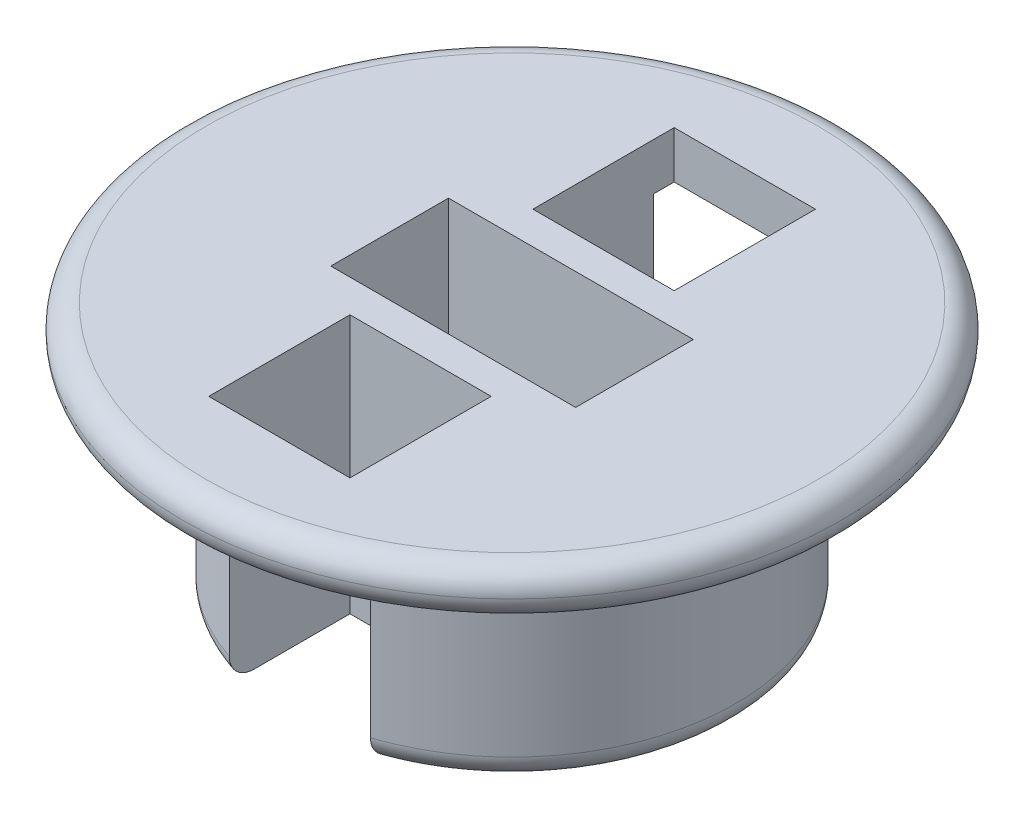
ISO-10303-21;
HEADER;
FILE_DESCRIPTION(('STEP AP214'),'2;1');
FILE_NAME('part.step','',(''),(''),'','','');
FILE_SCHEMA(('AUTOMOTIVE_DESIGN { 1 0 10303 214 1 1 1 1 }'));
ENDSEC;
DATA;
#1=APPLICATION_CONTEXT('core data for automotive mechanical design processes');
#2=APPLICATION_PROTOCOL_DEFINITION('international standard','automotive_design',2000,#1);
#3=PRODUCT_CONTEXT('',#1,'mechanical');
#4=PRODUCT('Part','Part','',(#3));
#5=PRODUCT_RELATED_PRODUCT_CATEGORY('part','',(#4));
#6=PRODUCT_DEFINITION_FORMATION('','',#4);
#7=PRODUCT_DEFINITION_CONTEXT('part definition',#1,'design');
#8=PRODUCT_DEFINITION('design','',#6,#7);
#9=PRODUCT_DEFINITION_SHAPE('','',#8);
#10=(LENGTH_UNIT() NAMED_UNIT(*) SI_UNIT(.MILLI.,.METRE.));
#11=(NAMED_UNIT(*) PLANE_ANGLE_UNIT() SI_UNIT($,.RADIAN.));
#12=(NAMED_UNIT(*) SI_UNIT($,.STERADIAN.) SOLID_ANGLE_UNIT());
#13=UNCERTAINTY_MEASURE_WITH_UNIT(LENGTH_MEASURE(1.E-05),#10,'distance_accuracy_value','');
#14=(GEOMETRIC_REPRESENTATION_CONTEXT(3) GLOBAL_UNCERTAINTY_ASSIGNED_CONTEXT((#13)) GLOBAL_UNIT_ASSIGNED_CONTEXT((#10,
#11,#12)) REPRESENTATION_CONTEXT('',''));
#15=CARTESIAN_POINT('',(0.,0.,0.));
#16=DIRECTION('',(0.,0.,1.));
#17=DIRECTION('',(1.,0.,0.));
#18=AXIS2_PLACEMENT_3D('',#15,#16,#17);
#19=CARTESIAN_POINT('',(0.,4.5,0.));
#20=DIRECTION('',(0.,-1.,0.));
#21=DIRECTION('',(0.,0.,-1.));
#22=AXIS2_PLACEMENT_3D('',#19,#20,#21);
#23=CYLINDRICAL_SURFACE('',#22,4.75);
#24=DIRECTION('',(0.,-1.,0.));
#25=VECTOR('',#24,1.);
#26=CARTESIAN_POINT('',(-1.5,4.5,-4.50693909432999));
#27=LINE('',#26,#25);
#28=CARTESIAN_POINT('',(-1.5,0.5,-4.50693909432999));
#29=VERTEX_POINT('',#28);
#30=CARTESIAN_POINT('',(-1.5,4.5,-4.50693909432999));
#31=VERTEX_POINT('',#30);
#32=EDGE_CURVE('E307',#29,#31,#27,.F.);
#33=ORIENTED_EDGE('',*,*,#32,.F.);
#34=CARTESIAN_POINT('',(0.,0.5,0.));
#35=DIRECTION('',(0.,1.,0.));
#36=DIRECTION('',(0.,0.,1.));
#37=AXIS2_PLACEMENT_3D('',#34,#35,#36);
#38=CIRCLE('',#37,4.75);
#39=CARTESIAN_POINT('',(-1.5,0.5,4.50693909432999));
#40=VERTEX_POINT('',#39);
#41=EDGE_CURVE('E376',#29,#40,#38,.T.);
#42=ORIENTED_EDGE('',*,*,#41,.T.);
#43=DIRECTION('',(0.,-1.,0.));
#44=VECTOR('',#43,1.);
#45=CARTESIAN_POINT('',(-1.5,4.5,4.50693909432999));
#46=LINE('',#45,#44);
#47=CARTESIAN_POINT('',(-1.5,4.5,4.50693909432999));
#48=VERTEX_POINT('',#47);
#49=EDGE_CURVE('E258',#40,#48,#46,.F.);
#50=ORIENTED_EDGE('',*,*,#49,.T.);
#51=CARTESIAN_POINT('',(0.,4.5,0.));
#52=DIRECTION('',(0.,1.,0.));
#53=DIRECTION('',(0.,0.,1.));
#54=AXIS2_PLACEMENT_3D('',#51,#52,#53);
#55=CIRCLE('',#54,4.75);
#56=EDGE_CURVE('E310',#31,#48,#55,.T.);
#57=ORIENTED_EDGE('',*,*,#56,.F.);
#58=EDGE_LOOP('',(#33,#42,#50,#57));
#59=FACE_BOUND('',#58,.T.);
#60=ADVANCED_FACE('F42',(#59),#23,.T.);
#61=DIRECTION('',(0.,-1.,0.));
#62=VECTOR('',#61,1.);
#63=CARTESIAN_POINT('',(1.5,4.5,4.50693909432999));
#64=LINE('',#63,#62);
#65=CARTESIAN_POINT('',(1.5,4.5,4.50693909432999));
#66=VERTEX_POINT('',#65);
#67=CARTESIAN_POINT('',(1.5,0.5,4.50693909432999));
#68=VERTEX_POINT('',#67);
#69=EDGE_CURVE('E299',#66,#68,#64,.T.);
#70=ORIENTED_EDGE('',*,*,#69,.T.);
#71=CARTESIAN_POINT('',(0.,0.5,0.));
#72=DIRECTION('',(0.,1.,0.));
#73=DIRECTION('',(0.,0.,1.));
#74=AXIS2_PLACEMENT_3D('',#71,#72,#73);
#75=CIRCLE('',#74,4.75);
#76=CARTESIAN_POINT('',(1.5,0.5,-4.50693909432999));
#77=VERTEX_POINT('',#76);
#78=EDGE_CURVE('E337',#68,#77,#75,.T.);
#79=ORIENTED_EDGE('',*,*,#78,.T.);
#80=DIRECTION('',(0.,-1.,0.));
#81=VECTOR('',#80,1.);
#82=CARTESIAN_POINT('',(1.5,4.5,-4.50693909432999));
#83=LINE('',#82,#81);
#84=CARTESIAN_POINT('',(1.5,4.5,-4.50693909432999));
#85=VERTEX_POINT('',#84);
#86=EDGE_CURVE('E303',#85,#77,#83,.T.);
#87=ORIENTED_EDGE('',*,*,#86,.F.);
#88=EDGE_CURVE('E311',#66,#85,#55,.T.);
#89=ORIENTED_EDGE('',*,*,#88,.F.);
#90=EDGE_LOOP('',(#70,#79,#87,#89));
#91=FACE_BOUND('',#90,.T.);
#92=ADVANCED_FACE('F394',(#91),#23,.T.);
#93=CARTESIAN_POINT('',(0.,0.,0.));
#94=DIRECTION('',(0.,1.,0.));
#95=DIRECTION('',(0.,0.,1.));
#96=AXIS2_PLACEMENT_3D('',#93,#94,#95);
#97=PLANE('',#96);
#98=DIRECTION('',(-1.,0.,0.));
#99=VECTOR('',#98,1.);
#100=CARTESIAN_POINT('',(0.,0.,-1.25));
#101=LINE('',#100,#99);
#102=CARTESIAN_POINT('',(2.6,0.,-1.25));
#103=VERTEX_POINT('',#102);
#104=CARTESIAN_POINT('',(-2.6,0.,-1.25));
#105=VERTEX_POINT('',#104);
#106=EDGE_CURVE('E209',#103,#105,#101,.T.);
#107=ORIENTED_EDGE('',*,*,#106,.T.);
#108=DIRECTION('',(0.,0.,1.));
#109=VECTOR('',#108,1.);
#110=CARTESIAN_POINT('',(-2.6,0.,0.));
#111=LINE('',#110,#109);
#112=CARTESIAN_POINT('',(-2.6,0.,1.25));
#113=VERTEX_POINT('',#112);
#114=EDGE_CURVE('E213',#105,#113,#111,.T.);
#115=ORIENTED_EDGE('',*,*,#114,.T.);
#116=DIRECTION('',(1.,0.,0.));
#117=VECTOR('',#116,1.);
#118=CARTESIAN_POINT('',(0.,0.,1.25));
#119=LINE('',#118,#117);
#120=CARTESIAN_POINT('',(2.6,0.,1.25));
#121=VERTEX_POINT('',#120);
#122=EDGE_CURVE('E200',#113,#121,#119,.T.);
#123=ORIENTED_EDGE('',*,*,#122,.T.);
#124=DIRECTION('',(0.,0.,-1.));
#125=VECTOR('',#124,1.);
#126=CARTESIAN_POINT('',(2.6,0.,0.));
#127=LINE('',#126,#125);
#128=EDGE_CURVE('E175',#121,#103,#127,.T.);
#129=ORIENTED_EDGE('',*,*,#128,.T.);
#130=EDGE_LOOP('',(#107,#115,#123,#129));
#131=FACE_BOUND('',#130,.T.);
#132=DIRECTION('',(0.,0.,1.));
#133=VECTOR('',#132,1.);
#134=CARTESIAN_POINT('',(1.5,0.,-4.94300276292383));
#135=LINE('',#134,#133);
#136=CARTESIAN_POINT('',(1.5,0.,-3.97649343014671));
#137=VERTEX_POINT('',#136);
#138=CARTESIAN_POINT('',(1.5,0.,-1.94300276292383));
#139=VERTEX_POINT('',#138);
#140=EDGE_CURVE('E225',#137,#139,#135,.T.);
#141=ORIENTED_EDGE('',*,*,#140,.F.);
#142=CARTESIAN_POINT('',(0.,0.,0.));
#143=DIRECTION('',(0.,1.,0.));
#144=DIRECTION('',(0.,0.,1.));
#145=AXIS2_PLACEMENT_3D('',#142,#143,#144);
#146=CIRCLE('',#145,4.25);
#147=CARTESIAN_POINT('',(1.5,0.,3.97649343014671));
#148=VERTEX_POINT('',#147);
#149=EDGE_CURVE('E377',#137,#148,#146,.F.);
#150=ORIENTED_EDGE('',*,*,#149,.T.);
#151=DIRECTION('',(0.,0.,-1.));
#152=VECTOR('',#151,1.);
#153=CARTESIAN_POINT('',(1.5,0.,4.94300276292383));
#154=LINE('',#153,#152);
#155=CARTESIAN_POINT('',(1.5,0.,1.94300276292383));
#156=VERTEX_POINT('',#155);
#157=EDGE_CURVE('E263',#148,#156,#154,.T.);
#158=ORIENTED_EDGE('',*,*,#157,.T.);
#159=DIRECTION('',(-1.,0.,0.));
#160=VECTOR('',#159,1.);
#161=CARTESIAN_POINT('',(1.5,0.,1.94300276292383));
#162=LINE('',#161,#160);
#163=CARTESIAN_POINT('',(-1.5,0.,1.94300276292383));
#164=VERTEX_POINT('',#163);
#165=EDGE_CURVE('E278',#156,#164,#162,.T.);
#166=ORIENTED_EDGE('',*,*,#165,.T.);
#167=DIRECTION('',(0.,0.,1.));
#168=VECTOR('',#167,1.);
#169=CARTESIAN_POINT('',(-1.5,0.,1.94300276292383));
#170=LINE('',#169,#168);
#171=CARTESIAN_POINT('',(-1.5,0.,3.97649343014671));
#172=VERTEX_POINT('',#171);
#173=EDGE_CURVE('E290',#164,#172,#170,.T.);
#174=ORIENTED_EDGE('',*,*,#173,.T.);
#175=CARTESIAN_POINT('',(0.,0.,0.));
#176=DIRECTION('',(0.,1.,0.));
#177=DIRECTION('',(0.,0.,1.));
#178=AXIS2_PLACEMENT_3D('',#175,#176,#177);
#179=CIRCLE('',#178,4.25);
#180=CARTESIAN_POINT('',(-1.5,0.,-3.97649343014671));
#181=VERTEX_POINT('',#180);
#182=EDGE_CURVE('E350',#172,#181,#179,.F.);
#183=ORIENTED_EDGE('',*,*,#182,.T.);
#184=DIRECTION('',(0.,0.,-1.));
#185=VECTOR('',#184,1.);
#186=CARTESIAN_POINT('',(-1.5,0.,-1.94300276292383));
#187=LINE('',#186,#185);
#188=CARTESIAN_POINT('',(-1.5,0.,-1.94300276292383));
#189=VERTEX_POINT('',#188);
#190=EDGE_CURVE('E220',#189,#181,#187,.T.);
#191=ORIENTED_EDGE('',*,*,#190,.F.);
#192=DIRECTION('',(-1.,0.,0.));
#193=VECTOR('',#192,1.);
#194=CARTESIAN_POINT('',(1.5,0.,-1.94300276292383));
#195=LINE('',#194,#193);
#196=EDGE_CURVE('E217',#139,#189,#195,.T.);
#197=ORIENTED_EDGE('',*,*,#196,.F.);
#198=EDGE_LOOP('',(#141,#150,#158,#166,#174,#183,#191,#197));
#199=FACE_BOUND('',#198,.T.);
#200=ADVANCED_FACE('F390',(#131,#199),#97,.F.);
#201=CARTESIAN_POINT('',(0.,5.5,0.));
#202=DIRECTION('',(0.,1.,0.));
#203=DIRECTION('',(0.,0.,1.));
#204=AXIS2_PLACEMENT_3D('',#201,#202,#203);
#205=PLANE('',#204);
#206=DIRECTION('',(0.,0.,1.));
#207=VECTOR('',#206,1.);
#208=CARTESIAN_POINT('',(-2.6,5.5,1.25));
#209=LINE('',#208,#207);
#210=CARTESIAN_POINT('',(-2.6,5.5,-1.25));
#211=VERTEX_POINT('',#210);
#212=CARTESIAN_POINT('',(-2.6,5.5,1.25));
#213=VERTEX_POINT('',#212);
#214=EDGE_CURVE('E67',#211,#213,#209,.T.);
#215=ORIENTED_EDGE('',*,*,#214,.F.);
#216=DIRECTION('',(-1.,0.,0.));
#217=VECTOR('',#216,1.);
#218=CARTESIAN_POINT('',(-2.6,5.5,-1.25));
#219=LINE('',#218,#217);
#220=CARTESIAN_POINT('',(2.6,5.5,-1.25));
#221=VERTEX_POINT('',#220);
#222=EDGE_CURVE('E190',#221,#211,#219,.T.);
#223=ORIENTED_EDGE('',*,*,#222,.F.);
#224=DIRECTION('',(0.,0.,-1.));
#225=VECTOR('',#224,1.);
#226=CARTESIAN_POINT('',(2.6,5.5,-1.25));
#227=LINE('',#226,#225);
#228=CARTESIAN_POINT('',(2.6,5.5,1.25));
#229=VERTEX_POINT('',#228);
#230=EDGE_CURVE('E172',#229,#221,#227,.T.);
#231=ORIENTED_EDGE('',*,*,#230,.F.);
#232=DIRECTION('',(1.,0.,0.));
#233=VECTOR('',#232,1.);
#234=CARTESIAN_POINT('',(2.6,5.5,1.25));
#235=LINE('',#234,#233);
#236=EDGE_CURVE('E182',#213,#229,#235,.T.);
#237=ORIENTED_EDGE('',*,*,#236,.F.);
#238=EDGE_LOOP('',(#215,#223,#231,#237));
#239=FACE_BOUND('',#238,.T.);
#240=CARTESIAN_POINT('',(0.,5.5,0.));
#241=DIRECTION('',(0.,1.,0.));
#242=DIRECTION('',(0.,0.,1.));
#243=AXIS2_PLACEMENT_3D('',#240,#241,#242);
#244=CIRCLE('',#243,6.5);
#245=CARTESIAN_POINT('',(0.,5.5,6.5));
#246=VERTEX_POINT('',#245);
#247=EDGE_CURVE('E11',#246,#246,#244,.T.);
#248=ORIENTED_EDGE('',*,*,#247,.T.);
#249=EDGE_LOOP('',(#248));
#250=FACE_BOUND('',#249,.T.);
#251=DIRECTION('',(-1.,0.,0.));
#252=VECTOR('',#251,1.);
#253=CARTESIAN_POINT('',(1.5,5.5,1.94300276292383));
#254=LINE('',#253,#252);
#255=CARTESIAN_POINT('',(1.5,5.5,1.94300276292383));
#256=VERTEX_POINT('',#255);
#257=CARTESIAN_POINT('',(-1.5,5.5,1.94300276292383));
#258=VERTEX_POINT('',#257);
#259=EDGE_CURVE('E234',#256,#258,#254,.T.);
#260=ORIENTED_EDGE('',*,*,#259,.F.);
#261=DIRECTION('',(0.,0.,-1.));
#262=VECTOR('',#261,1.);
#263=CARTESIAN_POINT('',(1.5,5.5,4.94300276292383));
#264=LINE('',#263,#262);
#265=CARTESIAN_POINT('',(1.5,5.5,4.94300276292383));
#266=VERTEX_POINT('',#265);
#267=EDGE_CURVE('E273',#266,#256,#264,.T.);
#268=ORIENTED_EDGE('',*,*,#267,.F.);
#269=DIRECTION('',(1.,0.,0.));
#270=VECTOR('',#269,1.);
#271=CARTESIAN_POINT('',(-1.5,5.5,4.94300276292383));
#272=LINE('',#271,#270);
#273=CARTESIAN_POINT('',(-1.5,5.5,4.94300276292383));
#274=VERTEX_POINT('',#273);
#275=EDGE_CURVE('E277',#274,#266,#272,.T.);
#276=ORIENTED_EDGE('',*,*,#275,.F.);
#277=DIRECTION('',(0.,0.,1.));
#278=VECTOR('',#277,1.);
#279=CARTESIAN_POINT('',(-1.5,5.5,1.94300276292383));
#280=LINE('',#279,#278);
#281=EDGE_CURVE('E282',#258,#274,#280,.T.);
#282=ORIENTED_EDGE('',*,*,#281,.F.);
#283=EDGE_LOOP('',(#260,#268,#276,#282));
#284=FACE_BOUND('',#283,.T.);
#285=DIRECTION('',(0.,0.,1.));
#286=VECTOR('',#285,1.);
#287=CARTESIAN_POINT('',(1.5,5.5,-4.94300276292383));
#288=LINE('',#287,#286);
#289=CARTESIAN_POINT('',(1.5,5.5,-4.94300276292383));
#290=VERTEX_POINT('',#289);
#291=CARTESIAN_POINT('',(1.5,5.5,-1.94300276292383));
#292=VERTEX_POINT('',#291);
#293=EDGE_CURVE('E221',#290,#292,#288,.T.);
#294=ORIENTED_EDGE('',*,*,#293,.T.);
#295=DIRECTION('',(-1.,0.,0.));
#296=VECTOR('',#295,1.);
#297=CARTESIAN_POINT('',(1.5,5.5,-1.94300276292383));
#298=LINE('',#297,#296);
#299=CARTESIAN_POINT('',(-1.5,5.5,-1.94300276292383));
#300=VERTEX_POINT('',#299);
#301=EDGE_CURVE('E229',#292,#300,#298,.T.);
#302=ORIENTED_EDGE('',*,*,#301,.T.);
#303=DIRECTION('',(0.,0.,-1.));
#304=VECTOR('',#303,1.);
#305=CARTESIAN_POINT('',(-1.5,5.5,-1.94300276292383));
#306=LINE('',#305,#304);
#307=CARTESIAN_POINT('',(-1.5,5.5,-4.94300276292383));
#308=VERTEX_POINT('',#307);
#309=EDGE_CURVE('E233',#300,#308,#306,.T.);
#310=ORIENTED_EDGE('',*,*,#309,.T.);
#311=DIRECTION('',(1.,0.,0.));
#312=VECTOR('',#311,1.);
#313=CARTESIAN_POINT('',(-1.5,5.5,-4.94300276292383));
#314=LINE('',#313,#312);
#315=EDGE_CURVE('E238',#308,#290,#314,.T.);
#316=ORIENTED_EDGE('',*,*,#315,.T.);
#317=EDGE_LOOP('',(#294,#302,#310,#316));
#318=FACE_BOUND('',#317,.T.);
#319=ADVANCED_FACE('F187',(#239,#250,#284,#318),#205,.T.);
#320=CARTESIAN_POINT('',(0.,4.5,0.));
#321=DIRECTION('',(0.,1.,0.));
#322=DIRECTION('',(0.,0.,1.));
#323=AXIS2_PLACEMENT_3D('',#320,#321,#322);
#324=PLANE('',#323);
#325=CARTESIAN_POINT('',(0.,4.5,0.));
#326=DIRECTION('',(0.,1.,0.));
#327=DIRECTION('',(0.,0.,1.));
#328=AXIS2_PLACEMENT_3D('',#325,#326,#327);
#329=CIRCLE('',#328,6.5);
#330=CARTESIAN_POINT('',(0.,4.5,6.5));
#331=VERTEX_POINT('',#330);
#332=EDGE_CURVE('E52',#331,#331,#329,.F.);
#333=ORIENTED_EDGE('',*,*,#332,.T.);
#334=EDGE_LOOP('',(#333));
#335=FACE_BOUND('',#334,.T.);
#336=DIRECTION('',(0.,0.,-1.));
#337=VECTOR('',#336,1.);
#338=CARTESIAN_POINT('',(-1.5,4.5,0.));
#339=LINE('',#338,#337);
#340=CARTESIAN_POINT('',(-1.5,4.5,-4.94300276292383));
#341=VERTEX_POINT('',#340);
#342=EDGE_CURVE('E334',#31,#341,#339,.T.);
#343=ORIENTED_EDGE('',*,*,#342,.F.);
#344=ORIENTED_EDGE('',*,*,#56,.T.);
#345=DIRECTION('',(0.,0.,1.));
#346=VECTOR('',#345,1.);
#347=CARTESIAN_POINT('',(-1.5,4.5,0.));
#348=LINE('',#347,#346);
#349=CARTESIAN_POINT('',(-1.5,4.5,4.94300276292383));
#350=VERTEX_POINT('',#349);
#351=EDGE_CURVE('E315',#48,#350,#348,.T.);
#352=ORIENTED_EDGE('',*,*,#351,.T.);
#353=DIRECTION('',(1.,0.,0.));
#354=VECTOR('',#353,1.);
#355=CARTESIAN_POINT('',(0.,4.5,4.94300276292383));
#356=LINE('',#355,#354);
#357=CARTESIAN_POINT('',(1.5,4.5,4.94300276292383));
#358=VERTEX_POINT('',#357);
#359=EDGE_CURVE('E319',#350,#358,#356,.T.);
#360=ORIENTED_EDGE('',*,*,#359,.T.);
#361=DIRECTION('',(0.,0.,-1.));
#362=VECTOR('',#361,1.);
#363=CARTESIAN_POINT('',(1.5,4.5,0.));
#364=LINE('',#363,#362);
#365=EDGE_CURVE('E323',#358,#66,#364,.T.);
#366=ORIENTED_EDGE('',*,*,#365,.T.);
#367=ORIENTED_EDGE('',*,*,#88,.T.);
#368=DIRECTION('',(0.,0.,1.));
#369=VECTOR('',#368,1.);
#370=CARTESIAN_POINT('',(1.5,4.5,0.));
#371=LINE('',#370,#369);
#372=CARTESIAN_POINT('',(1.5,4.5,-4.94300276292383));
#373=VERTEX_POINT('',#372);
#374=EDGE_CURVE('E327',#373,#85,#371,.T.);
#375=ORIENTED_EDGE('',*,*,#374,.F.);
#376=DIRECTION('',(1.,0.,0.));
#377=VECTOR('',#376,1.);
#378=CARTESIAN_POINT('',(0.,4.5,-4.94300276292383));
#379=LINE('',#378,#377);
#380=EDGE_CURVE('E330',#341,#373,#379,.T.);
#381=ORIENTED_EDGE('',*,*,#380,.F.);
#382=EDGE_LOOP('',(#343,#344,#352,#360,#366,#367,#375,#381));
#383=FACE_BOUND('',#382,.T.);
#384=ADVANCED_FACE('F385',(#335,#383),#324,.F.);
#385=CARTESIAN_POINT('',(1.5,0.,4.94300276292383));
#386=DIRECTION('',(1.,0.,0.));
#387=DIRECTION('',(0.,0.,-1.));
#388=AXIS2_PLACEMENT_3D('',#385,#386,#387);
#389=PLANE('',#388);
#390=ORIENTED_EDGE('',*,*,#157,.F.);
#391=CARTESIAN_POINT('',(1.5,0.,3.97649343014671));
#392=CARTESIAN_POINT('',(1.5,-1.90297228874315E-05,4.00781883638583));
#393=CARTESIAN_POINT('',(1.5,0.00257655158657322,4.03915558186936));
#394=CARTESIAN_POINT('',(1.5,0.0129239785237182,4.1010132462108));
#395=CARTESIAN_POINT('',(1.5,0.0206836838287416,4.13153284762884));
#396=CARTESIAN_POINT('',(1.5,0.0413011567694495,4.190860414418));
#397=CARTESIAN_POINT('',(1.5,0.0541664199684784,4.21966579128137));
#398=CARTESIAN_POINT('',(1.5,0.0847337451346356,4.2745626951379));
#399=CARTESIAN_POINT('',(1.5,0.102431379454095,4.30065667637192));
#400=CARTESIAN_POINT('',(1.5,0.141464793671651,4.3482741963715));
#401=CARTESIAN_POINT('',(1.5,0.162630545244519,4.36993690893798));
#402=CARTESIAN_POINT('',(1.5,0.208502957983056,4.4091435099523));
#403=CARTESIAN_POINT('',(1.5,0.233209826482315,4.42668715706867));
#404=CARTESIAN_POINT('',(1.5,0.283921376005854,4.45608514220175));
#405=CARTESIAN_POINT('',(1.5,0.309771109149881,4.46820739801906));
#406=CARTESIAN_POINT('',(1.5,0.363187807183796,4.48769659103183));
#407=CARTESIAN_POINT('',(1.5,0.390752288066988,4.49507023897244));
#408=CARTESIAN_POINT('',(1.5,0.432149218400446,4.50226233098433));
#409=CARTESIAN_POINT('',(1.5,0.445670275862671,4.50401565713535));
#410=CARTESIAN_POINT('',(1.5,0.472791871608395,4.50635313481972));
#411=CARTESIAN_POINT('',(1.5,0.486392253545484,4.50693910074953));
#412=CARTESIAN_POINT('',(1.5,0.49999999999997,4.50693909433016));
#413=B_SPLINE_CURVE_WITH_KNOTS('',3,(#391,#392,#393,#394,#395,#396,#397,#398,#399,#400,#401,
#402,#403,#404,#405,#406,#407,#408,#409,#410,#411,#412),.UNSPECIFIED.,.F.,.F.,(4,2,2,2,2,2,2,2,
2,2,4),(0.,0.0938875176928748,0.187918257811043,0.282087559939445,0.376170867547543,
0.466562026663046,0.556958480375076,0.642186973448154,0.727294755538276,0.768154397861391,
0.808950483444731),.UNSPECIFIED.);
#414=EDGE_CURVE('E368',#148,#68,#413,.T.);
#415=ORIENTED_EDGE('',*,*,#414,.T.);
#416=ORIENTED_EDGE('',*,*,#69,.F.);
#417=ORIENTED_EDGE('',*,*,#365,.F.);
#418=DIRECTION('',(0.,1.,0.));
#419=VECTOR('',#418,1.);
#420=CARTESIAN_POINT('',(1.5,0.,4.94300276292383));
#421=LINE('',#420,#419);
#422=EDGE_CURVE('E267',#358,#266,#421,.T.);
#423=ORIENTED_EDGE('',*,*,#422,.T.);
#424=ORIENTED_EDGE('',*,*,#267,.T.);
#425=DIRECTION('',(0.,1.,0.));
#426=VECTOR('',#425,1.);
#427=CARTESIAN_POINT('',(1.5,0.,1.94300276292383));
#428=LINE('',#427,#426);
#429=EDGE_CURVE('E270',#156,#256,#428,.T.);
#430=ORIENTED_EDGE('',*,*,#429,.F.);
#431=EDGE_LOOP('',(#390,#415,#416,#417,#423,#424,#430));
#432=FACE_BOUND('',#431,.T.);
#433=ADVANCED_FACE('F379',(#432),#389,.F.);
#434=CARTESIAN_POINT('',(-1.5,0.,4.94300276292383));
#435=DIRECTION('',(0.,0.,1.));
#436=DIRECTION('',(1.,0.,0.));
#437=AXIS2_PLACEMENT_3D('',#434,#435,#436);
#438=PLANE('',#437);
#439=DIRECTION('',(0.,1.,0.));
#440=VECTOR('',#439,1.);
#441=CARTESIAN_POINT('',(-1.5,0.,4.94300276292383));
#442=LINE('',#441,#440);
#443=EDGE_CURVE('E264',#350,#274,#442,.T.);
#444=ORIENTED_EDGE('',*,*,#443,.T.);
#445=ORIENTED_EDGE('',*,*,#275,.T.);
#446=ORIENTED_EDGE('',*,*,#422,.F.);
#447=ORIENTED_EDGE('',*,*,#359,.F.);
#448=EDGE_LOOP('',(#444,#445,#446,#447));
#449=FACE_BOUND('',#448,.T.);
#450=ADVANCED_FACE('F384',(#449),#438,.F.);
#451=CARTESIAN_POINT('',(-1.5,0.,1.94300276292383));
#452=DIRECTION('',(-1.,0.,0.));
#453=DIRECTION('',(0.,0.,1.));
#454=AXIS2_PLACEMENT_3D('',#451,#452,#453);
#455=PLANE('',#454);
#456=ORIENTED_EDGE('',*,*,#49,.F.);
#457=CARTESIAN_POINT('',(-1.5,0.5,4.50693909432999));
#458=CARTESIAN_POINT('',(-1.5,0.472941807688754,4.50696819813257));
#459=CARTESIAN_POINT('',(-1.5,0.445898302225649,4.50462617944445));
#460=CARTESIAN_POINT('',(-1.5,0.392647814736654,4.49542367496867));
#461=CARTESIAN_POINT('',(-1.5,0.366439187963307,4.48857273409624));
#462=CARTESIAN_POINT('',(-1.5,0.315544416933487,4.47057422343053));
#463=CARTESIAN_POINT('',(-1.5,0.290858313040151,4.45942653978436));
#464=CARTESIAN_POINT('',(-1.5,0.2436550415158,4.4332252329153));
#465=CARTESIAN_POINT('',(-1.5,0.221138297046854,4.41817084974608));
#466=CARTESIAN_POINT('',(-1.5,0.178398584009567,4.38430261275517));
#467=CARTESIAN_POINT('',(-1.5,0.158230586074154,4.36541950391339));
#468=CARTESIAN_POINT('',(-1.5,0.121172012175598,4.32467558589832));
#469=CARTESIAN_POINT('',(-1.5,0.104282105971835,4.30281416976532));
#470=CARTESIAN_POINT('',(-1.5,0.0733740202503934,4.25560981646363));
#471=CARTESIAN_POINT('',(-1.5,0.0595358915140557,4.2301491358149));
#472=CARTESIAN_POINT('',(-1.5,0.0360727027012158,4.17735000653873));
#473=CARTESIAN_POINT('',(-1.5,0.0264489636907855,4.15001097221449));
#474=CARTESIAN_POINT('',(-1.5,0.0126715833274911,4.09836316162424));
#475=CARTESIAN_POINT('',(-1.5,0.00791525377067144,4.07421239915938));
#476=CARTESIAN_POINT('',(-1.5,0.00157945437579031,4.02553866840097));
#477=CARTESIAN_POINT('',(-1.5,-5.38873203067304E-06,4.00101640069201));
#478=CARTESIAN_POINT('',(-1.5,0.,3.97649343014671));
#479=B_SPLINE_CURVE_WITH_KNOTS('',3,(#457,#458,#459,#460,#461,#462,#463,#464,#465,#466,#467,
#468,#469,#470,#471,#472,#473,#474,#475,#476,#477,#478),.UNSPECIFIED.,.F.,.F.,(4,2,2,2,2,2,2,2,
2,2,4),(0.,0.0810509286106797,0.16193083040519,0.2428128754612,0.323710665815007,
0.406228650660219,0.488763477361417,0.575320309304438,0.66190425444599,0.735543847123456,
0.809058570423225),.UNSPECIFIED.);
#480=EDGE_CURVE('E418',#40,#172,#479,.T.);
#481=ORIENTED_EDGE('',*,*,#480,.T.);
#482=ORIENTED_EDGE('',*,*,#173,.F.);
#483=DIRECTION('',(0.,1.,0.));
#484=VECTOR('',#483,1.);
#485=CARTESIAN_POINT('',(-1.5,0.,1.94300276292383));
#486=LINE('',#485,#484);
#487=EDGE_CURVE('E259',#164,#258,#486,.T.);
#488=ORIENTED_EDGE('',*,*,#487,.T.);
#489=ORIENTED_EDGE('',*,*,#281,.T.);
#490=ORIENTED_EDGE('',*,*,#443,.F.);
#491=ORIENTED_EDGE('',*,*,#351,.F.);
#492=EDGE_LOOP('',(#456,#481,#482,#488,#489,#490,#491));
#493=FACE_BOUND('',#492,.T.);
#494=ADVANCED_FACE('F435',(#493),#455,.F.);
#495=CARTESIAN_POINT('',(1.5,0.,1.94300276292383));
#496=DIRECTION('',(0.,0.,-1.));
#497=DIRECTION('',(-1.,0.,0.));
#498=AXIS2_PLACEMENT_3D('',#495,#496,#497);
#499=PLANE('',#498);
#500=ORIENTED_EDGE('',*,*,#259,.T.);
#501=ORIENTED_EDGE('',*,*,#487,.F.);
#502=ORIENTED_EDGE('',*,*,#165,.F.);
#503=ORIENTED_EDGE('',*,*,#429,.T.);
#504=EDGE_LOOP('',(#500,#501,#502,#503));
#505=FACE_BOUND('',#504,.T.);
#506=ADVANCED_FACE('F439',(#505),#499,.F.);
#507=CARTESIAN_POINT('',(-1.5,0.,-1.94300276292383));
#508=DIRECTION('',(1.,0.,0.));
#509=DIRECTION('',(0.,0.,-1.));
#510=AXIS2_PLACEMENT_3D('',#507,#508,#509);
#511=PLANE('',#510);
#512=ORIENTED_EDGE('',*,*,#190,.T.);
#513=CARTESIAN_POINT('',(-1.5,0.,-3.97649343014671));
#514=CARTESIAN_POINT('',(-1.5,-1.90297228876087E-05,-4.00781883638583));
#515=CARTESIAN_POINT('',(-1.5,0.00257655158657308,-4.03915558186936));
#516=CARTESIAN_POINT('',(-1.5,0.0129239785237182,-4.1010132462108));
#517=CARTESIAN_POINT('',(-1.5,0.0206836838287417,-4.13153284762884));
#518=CARTESIAN_POINT('',(-1.5,0.0413011567694494,-4.190860414418));
#519=CARTESIAN_POINT('',(-1.5,0.0541664199684781,-4.21966579128137));
#520=CARTESIAN_POINT('',(-1.5,0.0847337451346353,-4.2745626951379));
#521=CARTESIAN_POINT('',(-1.5,0.102431379454095,-4.30065667637192));
#522=CARTESIAN_POINT('',(-1.5,0.141464793671651,-4.3482741963715));
#523=CARTESIAN_POINT('',(-1.5,0.162630545244519,-4.36993690893798));
#524=CARTESIAN_POINT('',(-1.5,0.208502957983055,-4.4091435099523));
#525=CARTESIAN_POINT('',(-1.5,0.233209826482315,-4.42668715706867));
#526=CARTESIAN_POINT('',(-1.5,0.283921376005854,-4.45608514220175));
#527=CARTESIAN_POINT('',(-1.5,0.309771109149881,-4.46820739801906));
#528=CARTESIAN_POINT('',(-1.5,0.363187807183796,-4.48769659103183));
#529=CARTESIAN_POINT('',(-1.5,0.390752288066988,-4.49507023897244));
#530=CARTESIAN_POINT('',(-1.5,0.432149218400446,-4.50226233098433));
#531=CARTESIAN_POINT('',(-1.5,0.445670275862671,-4.50401565713535));
#532=CARTESIAN_POINT('',(-1.5,0.472791871608395,-4.50635313481972));
#533=CARTESIAN_POINT('',(-1.5,0.486392253545484,-4.50693910074953));
#534=CARTESIAN_POINT('',(-1.5,0.49999999999997,-4.50693909433016));
#535=B_SPLINE_CURVE_WITH_KNOTS('',3,(#513,#514,#515,#516,#517,#518,#519,#520,#521,#522,#523,
#524,#525,#526,#527,#528,#529,#530,#531,#532,#533,#534),.UNSPECIFIED.,.F.,.F.,(4,2,2,2,2,2,2,2,
2,2,4),(0.,0.0938875176928748,0.187918257811043,0.282087559939445,0.376170867547543,
0.466562026663046,0.556958480375076,0.642186973448155,0.727294755538276,0.768154397861392,
0.808950483444732),.UNSPECIFIED.);
#536=EDGE_CURVE('E417',#181,#29,#535,.T.);
#537=ORIENTED_EDGE('',*,*,#536,.T.);
#538=ORIENTED_EDGE('',*,*,#32,.T.);
#539=ORIENTED_EDGE('',*,*,#342,.T.);
#540=DIRECTION('',(0.,1.,0.));
#541=VECTOR('',#540,1.);
#542=CARTESIAN_POINT('',(-1.5,0.,-4.94300276292383));
#543=LINE('',#542,#541);
#544=EDGE_CURVE('E251',#341,#308,#543,.T.);
#545=ORIENTED_EDGE('',*,*,#544,.T.);
#546=ORIENTED_EDGE('',*,*,#309,.F.);
#547=DIRECTION('',(0.,1.,0.));
#548=VECTOR('',#547,1.);
#549=CARTESIAN_POINT('',(-1.5,0.,-1.94300276292383));
#550=LINE('',#549,#548);
#551=EDGE_CURVE('E254',#189,#300,#550,.T.);
#552=ORIENTED_EDGE('',*,*,#551,.F.);
#553=EDGE_LOOP('',(#512,#537,#538,#539,#545,#546,#552));
#554=FACE_BOUND('',#553,.T.);
#555=ADVANCED_FACE('F442',(#554),#511,.T.);
#556=CARTESIAN_POINT('',(-1.5,0.,-4.94300276292383));
#557=DIRECTION('',(0.,0.,1.));
#558=DIRECTION('',(1.,0.,0.));
#559=AXIS2_PLACEMENT_3D('',#556,#557,#558);
#560=PLANE('',#559);
#561=ORIENTED_EDGE('',*,*,#380,.T.);
#562=DIRECTION('',(0.,1.,0.));
#563=VECTOR('',#562,1.);
#564=CARTESIAN_POINT('',(1.5,0.,-4.94300276292383));
#565=LINE('',#564,#563);
#566=EDGE_CURVE('E248',#373,#290,#565,.T.);
#567=ORIENTED_EDGE('',*,*,#566,.T.);
#568=ORIENTED_EDGE('',*,*,#315,.F.);
#569=ORIENTED_EDGE('',*,*,#544,.F.);
#570=EDGE_LOOP('',(#561,#567,#568,#569));
#571=FACE_BOUND('',#570,.T.);
#572=ADVANCED_FACE('F448',(#571),#560,.T.);
#573=CARTESIAN_POINT('',(1.5,0.,-4.94300276292383));
#574=DIRECTION('',(-1.,0.,0.));
#575=DIRECTION('',(0.,0.,1.));
#576=AXIS2_PLACEMENT_3D('',#573,#574,#575);
#577=PLANE('',#576);
#578=ORIENTED_EDGE('',*,*,#86,.T.);
#579=CARTESIAN_POINT('',(1.5,0.5,-4.50693909432999));
#580=CARTESIAN_POINT('',(1.5,0.472941807688754,-4.50696819813257));
#581=CARTESIAN_POINT('',(1.5,0.445898302225648,-4.50462617944445));
#582=CARTESIAN_POINT('',(1.5,0.392647814736654,-4.49542367496867));
#583=CARTESIAN_POINT('',(1.5,0.366439187963307,-4.48857273409624));
#584=CARTESIAN_POINT('',(1.5,0.315544416933487,-4.47057422343053));
#585=CARTESIAN_POINT('',(1.5,0.290858313040151,-4.45942653978436));
#586=CARTESIAN_POINT('',(1.5,0.2436550415158,-4.4332252329153));
#587=CARTESIAN_POINT('',(1.5,0.221138297046854,-4.41817084974608));
#588=CARTESIAN_POINT('',(1.5,0.178398584009567,-4.38430261275517));
#589=CARTESIAN_POINT('',(1.5,0.158230586074154,-4.36541950391339));
#590=CARTESIAN_POINT('',(1.5,0.121172012175598,-4.32467558589832));
#591=CARTESIAN_POINT('',(1.5,0.104282105971835,-4.30281416976532));
#592=CARTESIAN_POINT('',(1.5,0.0733740202503933,-4.25560981646363));
#593=CARTESIAN_POINT('',(1.5,0.0595358915140557,-4.2301491358149));
#594=CARTESIAN_POINT('',(1.5,0.0360727027012159,-4.17735000653873));
#595=CARTESIAN_POINT('',(1.5,0.0264489636907855,-4.15001097221449));
#596=CARTESIAN_POINT('',(1.5,0.0126715833274911,-4.09836316162424));
#597=CARTESIAN_POINT('',(1.5,0.00791525377067145,-4.07421239915938));
#598=CARTESIAN_POINT('',(1.5,0.00157945437579037,-4.02553866840097));
#599=CARTESIAN_POINT('',(1.5,-5.38873203061099E-06,-4.00101640069201));
#600=CARTESIAN_POINT('',(1.5,0.,-3.97649343014671));
#601=B_SPLINE_CURVE_WITH_KNOTS('',3,(#579,#580,#581,#582,#583,#584,#585,#586,#587,#588,#589,
#590,#591,#592,#593,#594,#595,#596,#597,#598,#599,#600),.UNSPECIFIED.,.F.,.F.,(4,2,2,2,2,2,2,2,
2,2,4),(0.,0.0810509286106798,0.16193083040519,0.2428128754612,0.323710665815007,
0.406228650660219,0.488763477361416,0.575320309304438,0.66190425444599,0.735543847123456,
0.809058570423225),.UNSPECIFIED.);
#602=EDGE_CURVE('E341',#77,#137,#601,.T.);
#603=ORIENTED_EDGE('',*,*,#602,.T.);
#604=ORIENTED_EDGE('',*,*,#140,.T.);
#605=DIRECTION('',(0.,1.,0.));
#606=VECTOR('',#605,1.);
#607=CARTESIAN_POINT('',(1.5,0.,-1.94300276292383));
#608=LINE('',#607,#606);
#609=EDGE_CURVE('E228',#139,#292,#608,.T.);
#610=ORIENTED_EDGE('',*,*,#609,.T.);
#611=ORIENTED_EDGE('',*,*,#293,.F.);
#612=ORIENTED_EDGE('',*,*,#566,.F.);
#613=ORIENTED_EDGE('',*,*,#374,.T.);
#614=EDGE_LOOP('',(#578,#603,#604,#610,#611,#612,#613));
#615=FACE_BOUND('',#614,.T.);
#616=ADVANCED_FACE('F352',(#615),#577,.T.);
#617=CARTESIAN_POINT('',(1.5,0.,-1.94300276292383));
#618=DIRECTION('',(0.,0.,-1.));
#619=DIRECTION('',(-1.,0.,0.));
#620=AXIS2_PLACEMENT_3D('',#617,#618,#619);
#621=PLANE('',#620);
#622=ORIENTED_EDGE('',*,*,#301,.F.);
#623=ORIENTED_EDGE('',*,*,#609,.F.);
#624=ORIENTED_EDGE('',*,*,#196,.T.);
#625=ORIENTED_EDGE('',*,*,#551,.T.);
#626=EDGE_LOOP('',(#622,#623,#624,#625));
#627=FACE_BOUND('',#626,.T.);
#628=ADVANCED_FACE('F362',(#627),#621,.T.);
#629=CARTESIAN_POINT('',(0.,0.5,0.));
#630=DIRECTION('',(0.,1.,0.));
#631=DIRECTION('',(0.,0.,1.));
#632=AXIS2_PLACEMENT_3D('',#629,#630,#631);
#633=TOROIDAL_SURFACE('',#632,4.25,0.5);
#634=ORIENTED_EDGE('',*,*,#414,.F.);
#635=ORIENTED_EDGE('',*,*,#149,.F.);
#636=ORIENTED_EDGE('',*,*,#602,.F.);
#637=ORIENTED_EDGE('',*,*,#78,.F.);
#638=EDGE_LOOP('',(#634,#635,#636,#637));
#639=FACE_BOUND('',#638,.T.);
#640=ADVANCED_FACE('F356',(#639),#633,.T.);
#641=CARTESIAN_POINT('',(0.,0.5,0.));
#642=DIRECTION('',(0.,1.,0.));
#643=DIRECTION('',(0.,0.,1.));
#644=AXIS2_PLACEMENT_3D('',#641,#642,#643);
#645=TOROIDAL_SURFACE('',#644,4.25,0.5);
#646=ORIENTED_EDGE('',*,*,#536,.F.);
#647=ORIENTED_EDGE('',*,*,#182,.F.);
#648=ORIENTED_EDGE('',*,*,#480,.F.);
#649=ORIENTED_EDGE('',*,*,#41,.F.);
#650=EDGE_LOOP('',(#646,#647,#648,#649));
#651=FACE_BOUND('',#650,.T.);
#652=ADVANCED_FACE('F361',(#651),#645,.T.);
#653=CARTESIAN_POINT('',(0.,5.,0.));
#654=DIRECTION('',(0.,1.,0.));
#655=DIRECTION('',(0.,0.,1.));
#656=AXIS2_PLACEMENT_3D('',#653,#654,#655);
#657=TOROIDAL_SURFACE('',#656,6.5,0.5);
#658=ORIENTED_EDGE('',*,*,#247,.F.);
#659=EDGE_LOOP('',(#658));
#660=FACE_BOUND('',#659,.T.);
#661=CARTESIAN_POINT('',(0.,5.,0.));
#662=DIRECTION('',(0.,1.,0.));
#663=DIRECTION('',(0.,0.,1.));
#664=AXIS2_PLACEMENT_3D('',#661,#662,#663);
#665=CIRCLE('',#664,7.);
#666=CARTESIAN_POINT('',(0.,5.,7.));
#667=VERTEX_POINT('',#666);
#668=EDGE_CURVE('E46',#667,#667,#665,.F.);
#669=ORIENTED_EDGE('',*,*,#668,.F.);
#670=EDGE_LOOP('',(#669));
#671=FACE_BOUND('',#670,.T.);
#672=ADVANCED_FACE('F44',(#660,#671),#657,.T.);
#673=CARTESIAN_POINT('',(0.,5.,0.));
#674=DIRECTION('',(0.,1.,0.));
#675=DIRECTION('',(0.,0.,1.));
#676=AXIS2_PLACEMENT_3D('',#673,#674,#675);
#677=TOROIDAL_SURFACE('',#676,6.5,0.5);
#678=ORIENTED_EDGE('',*,*,#332,.F.);
#679=EDGE_LOOP('',(#678));
#680=FACE_BOUND('',#679,.T.);
#681=ORIENTED_EDGE('',*,*,#668,.T.);
#682=EDGE_LOOP('',(#681));
#683=FACE_BOUND('',#682,.T.);
#684=ADVANCED_FACE('F479',(#680,#683),#677,.T.);
#685=CARTESIAN_POINT('',(-2.6,-0.0331721241223623,1.25));
#686=DIRECTION('',(-1.,0.,0.));
#687=DIRECTION('',(0.,0.,1.));
#688=AXIS2_PLACEMENT_3D('',#685,#686,#687);
#689=PLANE('',#688);
#690=DIRECTION('',(0.,1.,0.));
#691=VECTOR('',#690,1.);
#692=CARTESIAN_POINT('',(-2.6,-0.0331721241223623,-1.25));
#693=LINE('',#692,#691);
#694=EDGE_CURVE('E197',#105,#211,#693,.T.);
#695=ORIENTED_EDGE('',*,*,#694,.T.);
#696=ORIENTED_EDGE('',*,*,#214,.T.);
#697=DIRECTION('',(0.,1.,0.));
#698=VECTOR('',#697,1.);
#699=CARTESIAN_POINT('',(-2.6,-0.0331721241223623,1.25));
#700=LINE('',#699,#698);
#701=EDGE_CURVE('E179',#113,#213,#700,.T.);
#702=ORIENTED_EDGE('',*,*,#701,.F.);
#703=ORIENTED_EDGE('',*,*,#114,.F.);
#704=EDGE_LOOP('',(#695,#696,#702,#703));
#705=FACE_BOUND('',#704,.T.);
#706=ADVANCED_FACE('F487',(#705),#689,.F.);
#707=CARTESIAN_POINT('',(-2.6,-0.0331721241223623,-1.25));
#708=DIRECTION('',(0.,0.,-1.));
#709=DIRECTION('',(-1.,0.,0.));
#710=AXIS2_PLACEMENT_3D('',#707,#708,#709);
#711=PLANE('',#710);
#712=DIRECTION('',(0.,1.,0.));
#713=VECTOR('',#712,1.);
#714=CARTESIAN_POINT('',(2.6,-0.0331721241223623,-1.25));
#715=LINE('',#714,#713);
#716=EDGE_CURVE('E178',#103,#221,#715,.T.);
#717=ORIENTED_EDGE('',*,*,#716,.T.);
#718=ORIENTED_EDGE('',*,*,#222,.T.);
#719=ORIENTED_EDGE('',*,*,#694,.F.);
#720=ORIENTED_EDGE('',*,*,#106,.F.);
#721=EDGE_LOOP('',(#717,#718,#719,#720));
#722=FACE_BOUND('',#721,.T.);
#723=ADVANCED_FACE('F561',(#722),#711,.F.);
#724=CARTESIAN_POINT('',(2.6,-0.0331721241223623,-1.25));
#725=DIRECTION('',(1.,0.,0.));
#726=DIRECTION('',(0.,0.,-1.));
#727=AXIS2_PLACEMENT_3D('',#724,#725,#726);
#728=PLANE('',#727);
#729=DIRECTION('',(0.,1.,0.));
#730=VECTOR('',#729,1.);
#731=CARTESIAN_POINT('',(2.6,-0.0331721241223623,1.25));
#732=LINE('',#731,#730);
#733=EDGE_CURVE('E59',#121,#229,#732,.T.);
#734=ORIENTED_EDGE('',*,*,#733,.T.);
#735=ORIENTED_EDGE('',*,*,#230,.T.);
#736=ORIENTED_EDGE('',*,*,#716,.F.);
#737=ORIENTED_EDGE('',*,*,#128,.F.);
#738=EDGE_LOOP('',(#734,#735,#736,#737));
#739=FACE_BOUND('',#738,.T.);
#740=ADVANCED_FACE('F169',(#739),#728,.F.);
#741=CARTESIAN_POINT('',(2.6,-0.0331721241223623,1.25));
#742=DIRECTION('',(0.,0.,1.));
#743=DIRECTION('',(1.,0.,0.));
#744=AXIS2_PLACEMENT_3D('',#741,#742,#743);
#745=PLANE('',#744);
#746=ORIENTED_EDGE('',*,*,#701,.T.);
#747=ORIENTED_EDGE('',*,*,#236,.T.);
#748=ORIENTED_EDGE('',*,*,#733,.F.);
#749=ORIENTED_EDGE('',*,*,#122,.F.);
#750=EDGE_LOOP('',(#746,#747,#748,#749));
#751=FACE_BOUND('',#750,.T.);
#752=ADVANCED_FACE('F183',(#751),#745,.F.);
#753=CLOSED_SHELL('',(#60,#92,#200,#319,#384,#433,#450,#494,#506,#555,#572,#616,#628,#640,#652,
#672,#684,#706,#723,#740,#752));
#754=MANIFOLD_SOLID_BREP('B2',#753);
#755=ADVANCED_BREP_SHAPE_REPRESENTATION('',(#18,#754),#14);
#756=SHAPE_DEFINITION_REPRESENTATION(#9,#755);
ENDSEC;
END-ISO-10303-21;
